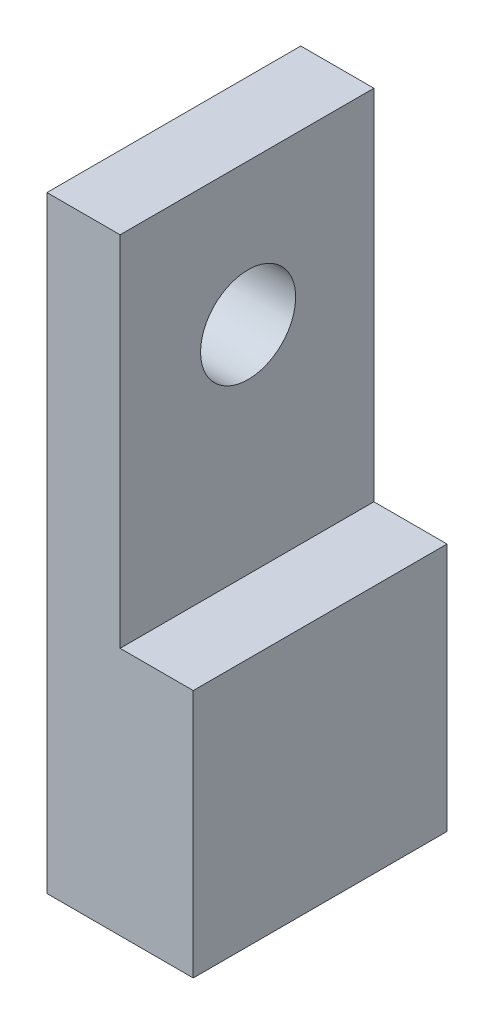
ISO-10303-21;
HEADER;
FILE_DESCRIPTION(('STEP AP214'),'2;1');
FILE_NAME('part.step','',(''),(''),'','','');
FILE_SCHEMA(('AUTOMOTIVE_DESIGN { 1 0 10303 214 1 1 1 1 }'));
ENDSEC;
DATA;
#1=APPLICATION_CONTEXT('core data for automotive mechanical design processes');
#2=APPLICATION_PROTOCOL_DEFINITION('international standard','automotive_design',2000,#1);
#3=PRODUCT_CONTEXT('',#1,'mechanical');
#4=PRODUCT('Part','Part','',(#3));
#5=PRODUCT_RELATED_PRODUCT_CATEGORY('part','',(#4));
#6=PRODUCT_DEFINITION_FORMATION('','',#4);
#7=PRODUCT_DEFINITION_CONTEXT('part definition',#1,'design');
#8=PRODUCT_DEFINITION('design','',#6,#7);
#9=PRODUCT_DEFINITION_SHAPE('','',#8);
#10=(LENGTH_UNIT() NAMED_UNIT(*) SI_UNIT(.MILLI.,.METRE.));
#11=(NAMED_UNIT(*) PLANE_ANGLE_UNIT() SI_UNIT($,.RADIAN.));
#12=(NAMED_UNIT(*) SI_UNIT($,.STERADIAN.) SOLID_ANGLE_UNIT());
#13=UNCERTAINTY_MEASURE_WITH_UNIT(LENGTH_MEASURE(1.E-05),#10,'distance_accuracy_value','');
#14=(GEOMETRIC_REPRESENTATION_CONTEXT(3) GLOBAL_UNCERTAINTY_ASSIGNED_CONTEXT((#13)) GLOBAL_UNIT_ASSIGNED_CONTEXT((#10,
#11,#12)) REPRESENTATION_CONTEXT('',''));
#15=CARTESIAN_POINT('',(0.,0.,0.));
#16=DIRECTION('',(0.,0.,1.));
#17=DIRECTION('',(1.,0.,0.));
#18=AXIS2_PLACEMENT_3D('',#15,#16,#17);
#19=CARTESIAN_POINT('',(-4.34310787671234,83.,-11.796875));
#20=DIRECTION('',(1.,0.,0.));
#21=DIRECTION('',(0.,0.,-1.));
#22=AXIS2_PLACEMENT_3D('',#19,#20,#21);
#23=PLANE('',#22);
#24=CARTESIAN_POINT('',(-4.34310787671234,51.1096452634034,-7.09687500000001));
#25=DIRECTION('',(-1.,0.,0.));
#26=DIRECTION('',(0.,0.,1.));
#27=AXIS2_PLACEMENT_3D('',#24,#25,#26);
#28=CIRCLE('',#27,1.24999999999999);
#29=CARTESIAN_POINT('',(-4.34310787671234,51.1096452634034,-5.84687500000002));
#30=VERTEX_POINT('',#29);
#31=EDGE_CURVE('E167',#30,#30,#28,.T.);
#32=ORIENTED_EDGE('',*,*,#31,.F.);
#33=EDGE_LOOP('',(#32));
#34=FACE_BOUND('',#33,.T.);
#35=CARTESIAN_POINT('',(-4.34310787671234,51.1096452634034,17.903125));
#36=DIRECTION('',(-1.,0.,0.));
#37=DIRECTION('',(0.,0.,1.));
#38=AXIS2_PLACEMENT_3D('',#35,#36,#37);
#39=CIRCLE('',#38,1.24999999999999);
#40=CARTESIAN_POINT('',(-4.34310787671234,51.1096452634034,19.153125));
#41=VERTEX_POINT('',#40);
#42=EDGE_CURVE('E161',#41,#41,#39,.T.);
#43=ORIENTED_EDGE('',*,*,#42,.F.);
#44=EDGE_LOOP('',(#43));
#45=FACE_BOUND('',#44,.T.);
#46=CARTESIAN_POINT('',(-4.34310787671234,76.1096452634034,17.903125));
#47=DIRECTION('',(-1.,0.,0.));
#48=DIRECTION('',(0.,0.,1.));
#49=AXIS2_PLACEMENT_3D('',#46,#47,#48);
#50=CIRCLE('',#49,1.24999999999999);
#51=CARTESIAN_POINT('',(-4.34310787671234,76.1096452634034,19.153125));
#52=VERTEX_POINT('',#51);
#53=EDGE_CURVE('E155',#52,#52,#50,.T.);
#54=ORIENTED_EDGE('',*,*,#53,.F.);
#55=EDGE_LOOP('',(#54));
#56=FACE_BOUND('',#55,.T.);
#57=CARTESIAN_POINT('',(-4.34310787671234,76.1096452634034,-7.09687500000001));
#58=DIRECTION('',(-1.,0.,0.));
#59=DIRECTION('',(0.,0.,1.));
#60=AXIS2_PLACEMENT_3D('',#57,#58,#59);
#61=CIRCLE('',#60,1.24999999999999);
#62=CARTESIAN_POINT('',(-4.34310787671234,76.1096452634034,-5.84687500000002));
#63=VERTEX_POINT('',#62);
#64=EDGE_CURVE('E149',#63,#63,#61,.T.);
#65=ORIENTED_EDGE('',*,*,#64,.F.);
#66=EDGE_LOOP('',(#65));
#67=FACE_BOUND('',#66,.T.);
#68=CARTESIAN_POINT('',(-4.34310787671234,63.6096452634034,5.40312499999999));
#69=DIRECTION('',(-1.,0.,0.));
#70=DIRECTION('',(0.,0.,1.));
#71=AXIS2_PLACEMENT_3D('',#68,#69,#70);
#72=CIRCLE('',#71,6.49999999999998);
#73=CARTESIAN_POINT('',(-4.34310787671234,63.6096452634034,11.903125));
#74=VERTEX_POINT('',#73);
#75=EDGE_CURVE('E143',#74,#74,#72,.T.);
#76=ORIENTED_EDGE('',*,*,#75,.F.);
#77=EDGE_LOOP('',(#76));
#78=FACE_BOUND('',#77,.T.);
#79=DIRECTION('',(0.,0.,1.));
#80=VECTOR('',#79,1.);
#81=CARTESIAN_POINT('',(-4.34310787671234,0.,-11.796875));
#82=LINE('',#81,#80);
#83=CARTESIAN_POINT('',(-4.34310787671234,0.,-11.796875));
#84=VERTEX_POINT('',#83);
#85=CARTESIAN_POINT('',(-4.34310787671233,0.,22.903125));
#86=VERTEX_POINT('',#85);
#87=EDGE_CURVE('E97',#84,#86,#82,.T.);
#88=ORIENTED_EDGE('',*,*,#87,.T.);
#89=DIRECTION('',(0.,-1.,0.));
#90=VECTOR('',#89,1.);
#91=CARTESIAN_POINT('',(-4.34310787671233,83.,22.903125));
#92=LINE('',#91,#90);
#93=CARTESIAN_POINT('',(-4.34310787671233,83.,22.903125));
#94=VERTEX_POINT('',#93);
#95=EDGE_CURVE('E11',#94,#86,#92,.T.);
#96=ORIENTED_EDGE('',*,*,#95,.F.);
#97=DIRECTION('',(0.,0.,1.));
#98=VECTOR('',#97,1.);
#99=CARTESIAN_POINT('',(-4.34310787671234,83.,-11.796875));
#100=LINE('',#99,#98);
#101=CARTESIAN_POINT('',(-4.34310787671234,83.,-11.796875));
#102=VERTEX_POINT('',#101);
#103=EDGE_CURVE('E91',#102,#94,#100,.T.);
#104=ORIENTED_EDGE('',*,*,#103,.F.);
#105=DIRECTION('',(0.,-1.,0.));
#106=VECTOR('',#105,1.);
#107=CARTESIAN_POINT('',(-4.34310787671234,83.,-11.796875));
#108=LINE('',#107,#106);
#109=EDGE_CURVE('E82',#102,#84,#108,.T.);
#110=ORIENTED_EDGE('',*,*,#109,.T.);
#111=EDGE_LOOP('',(#88,#96,#104,#110));
#112=FACE_BOUND('',#111,.T.);
#113=ADVANCED_FACE('F38',(#34,#45,#56,#67,#78,#112),#23,.F.);
#114=CARTESIAN_POINT('',(-4.34310787671233,83.,22.903125));
#115=DIRECTION('',(0.,0.,-1.));
#116=DIRECTION('',(-1.,0.,0.));
#117=AXIS2_PLACEMENT_3D('',#114,#115,#116);
#118=PLANE('',#117);
#119=DIRECTION('',(1.,0.,0.));
#120=VECTOR('',#119,1.);
#121=CARTESIAN_POINT('',(5.65689212328766,34.0349991484665,22.903125));
#122=LINE('',#121,#120);
#123=CARTESIAN_POINT('',(5.65689212328766,34.0349991484665,22.903125));
#124=VERTEX_POINT('',#123);
#125=CARTESIAN_POINT('',(15.6568921232877,34.0349991484665,22.903125));
#126=VERTEX_POINT('',#125);
#127=EDGE_CURVE('E137',#124,#126,#122,.T.);
#128=ORIENTED_EDGE('',*,*,#127,.F.);
#129=DIRECTION('',(0.,-1.,0.));
#130=VECTOR('',#129,1.);
#131=CARTESIAN_POINT('',(5.65689212328766,83.,22.903125));
#132=LINE('',#131,#130);
#133=CARTESIAN_POINT('',(5.65689212328766,83.,22.903125));
#134=VERTEX_POINT('',#133);
#135=EDGE_CURVE('E125',#134,#124,#132,.T.);
#136=ORIENTED_EDGE('',*,*,#135,.F.);
#137=DIRECTION('',(1.,0.,0.));
#138=VECTOR('',#137,1.);
#139=CARTESIAN_POINT('',(-4.34310787671233,83.,22.903125));
#140=LINE('',#139,#138);
#141=EDGE_CURVE('E122',#94,#134,#140,.T.);
#142=ORIENTED_EDGE('',*,*,#141,.F.);
#143=ORIENTED_EDGE('',*,*,#95,.T.);
#144=DIRECTION('',(1.,0.,0.));
#145=VECTOR('',#144,1.);
#146=CARTESIAN_POINT('',(-4.34310787671233,0.,22.903125));
#147=LINE('',#146,#145);
#148=CARTESIAN_POINT('',(15.6568921232877,0.,22.903125));
#149=VERTEX_POINT('',#148);
#150=EDGE_CURVE('E101',#86,#149,#147,.T.);
#151=ORIENTED_EDGE('',*,*,#150,.T.);
#152=DIRECTION('',(0.,-1.,0.));
#153=VECTOR('',#152,1.);
#154=CARTESIAN_POINT('',(15.6568921232877,83.,22.903125));
#155=LINE('',#154,#153);
#156=EDGE_CURVE('E45',#126,#149,#155,.T.);
#157=ORIENTED_EDGE('',*,*,#156,.F.);
#158=EDGE_LOOP('',(#128,#136,#142,#143,#151,#157));
#159=FACE_BOUND('',#158,.T.);
#160=ADVANCED_FACE('F119',(#159),#118,.F.);
#161=CARTESIAN_POINT('',(15.6568921232877,83.,-11.796875));
#162=DIRECTION('',(-1.,0.,0.));
#163=DIRECTION('',(0.,0.,1.));
#164=AXIS2_PLACEMENT_3D('',#161,#162,#163);
#165=PLANE('',#164);
#166=DIRECTION('',(0.,-1.,0.));
#167=VECTOR('',#166,1.);
#168=CARTESIAN_POINT('',(15.6568921232877,83.,-11.796875));
#169=LINE('',#168,#167);
#170=CARTESIAN_POINT('',(15.6568921232877,34.0349991484665,-11.796875));
#171=VERTEX_POINT('',#170);
#172=CARTESIAN_POINT('',(15.6568921232877,0.,-11.796875));
#173=VERTEX_POINT('',#172);
#174=EDGE_CURVE('E86',#171,#173,#169,.T.);
#175=ORIENTED_EDGE('',*,*,#174,.F.);
#176=DIRECTION('',(0.,0.,-1.));
#177=VECTOR('',#176,1.);
#178=CARTESIAN_POINT('',(15.6568921232877,34.0349991484665,22.904125));
#179=LINE('',#178,#177);
#180=EDGE_CURVE('E105',#126,#171,#179,.T.);
#181=ORIENTED_EDGE('',*,*,#180,.F.);
#182=ORIENTED_EDGE('',*,*,#156,.T.);
#183=DIRECTION('',(0.,0.,-1.));
#184=VECTOR('',#183,1.);
#185=CARTESIAN_POINT('',(15.6568921232877,0.,-11.796875));
#186=LINE('',#185,#184);
#187=EDGE_CURVE('E92',#149,#173,#186,.T.);
#188=ORIENTED_EDGE('',*,*,#187,.T.);
#189=EDGE_LOOP('',(#175,#181,#182,#188));
#190=FACE_BOUND('',#189,.T.);
#191=ADVANCED_FACE('F114',(#190),#165,.F.);
#192=CARTESIAN_POINT('',(-4.34310787671234,83.,-11.796875));
#193=DIRECTION('',(0.,0.,1.));
#194=DIRECTION('',(1.,0.,0.));
#195=AXIS2_PLACEMENT_3D('',#192,#193,#194);
#196=PLANE('',#195);
#197=DIRECTION('',(-1.,0.,0.));
#198=VECTOR('',#197,1.);
#199=CARTESIAN_POINT('',(-4.34310787671234,83.,-11.796875));
#200=LINE('',#199,#198);
#201=CARTESIAN_POINT('',(5.65689212328766,83.,-11.796875));
#202=VERTEX_POINT('',#201);
#203=EDGE_CURVE('E60',#202,#102,#200,.T.);
#204=ORIENTED_EDGE('',*,*,#203,.F.);
#205=DIRECTION('',(0.,1.,0.));
#206=VECTOR('',#205,1.);
#207=CARTESIAN_POINT('',(5.65689212328766,83.,-11.796875));
#208=LINE('',#207,#206);
#209=CARTESIAN_POINT('',(5.65689212328766,34.0349991484665,-11.796875));
#210=VERTEX_POINT('',#209);
#211=EDGE_CURVE('E52',#210,#202,#208,.T.);
#212=ORIENTED_EDGE('',*,*,#211,.F.);
#213=DIRECTION('',(-1.,0.,0.));
#214=VECTOR('',#213,1.);
#215=CARTESIAN_POINT('',(5.65689212328766,34.0349991484665,-11.796875));
#216=LINE('',#215,#214);
#217=EDGE_CURVE('E131',#171,#210,#216,.T.);
#218=ORIENTED_EDGE('',*,*,#217,.F.);
#219=ORIENTED_EDGE('',*,*,#174,.T.);
#220=DIRECTION('',(-1.,0.,0.));
#221=VECTOR('',#220,1.);
#222=CARTESIAN_POINT('',(-4.34310787671234,0.,-11.796875));
#223=LINE('',#222,#221);
#224=EDGE_CURVE('E79',#173,#84,#223,.T.);
#225=ORIENTED_EDGE('',*,*,#224,.T.);
#226=ORIENTED_EDGE('',*,*,#109,.F.);
#227=EDGE_LOOP('',(#204,#212,#218,#219,#225,#226));
#228=FACE_BOUND('',#227,.T.);
#229=ADVANCED_FACE('F81',(#228),#196,.F.);
#230=CARTESIAN_POINT('',(0.,83.,0.));
#231=DIRECTION('',(0.,1.,0.));
#232=DIRECTION('',(0.,0.,1.));
#233=AXIS2_PLACEMENT_3D('',#230,#231,#232);
#234=PLANE('',#233);
#235=DIRECTION('',(0.,0.,-1.));
#236=VECTOR('',#235,1.);
#237=CARTESIAN_POINT('',(5.65689212328766,83.,22.904125));
#238=LINE('',#237,#236);
#239=EDGE_CURVE('E129',#134,#202,#238,.T.);
#240=ORIENTED_EDGE('',*,*,#239,.T.);
#241=ORIENTED_EDGE('',*,*,#203,.T.);
#242=ORIENTED_EDGE('',*,*,#103,.T.);
#243=ORIENTED_EDGE('',*,*,#141,.T.);
#244=EDGE_LOOP('',(#240,#241,#242,#243));
#245=FACE_BOUND('',#244,.T.);
#246=ADVANCED_FACE('F126',(#245),#234,.T.);
#247=CARTESIAN_POINT('',(0.,0.,0.));
#248=DIRECTION('',(0.,1.,0.));
#249=DIRECTION('',(0.,0.,1.));
#250=AXIS2_PLACEMENT_3D('',#247,#248,#249);
#251=PLANE('',#250);
#252=CARTESIAN_POINT('',(5.65689212328767,0.,17.903125));
#253=DIRECTION('',(0.,-1.,0.));
#254=DIRECTION('',(0.,0.,-1.));
#255=AXIS2_PLACEMENT_3D('',#252,#253,#254);
#256=CIRCLE('',#255,2.);
#257=CARTESIAN_POINT('',(5.65689212328767,0.,15.903125));
#258=VERTEX_POINT('',#257);
#259=EDGE_CURVE('E185',#258,#258,#256,.T.);
#260=ORIENTED_EDGE('',*,*,#259,.F.);
#261=EDGE_LOOP('',(#260));
#262=FACE_BOUND('',#261,.T.);
#263=CARTESIAN_POINT('',(5.65689212328767,0.,-6.796875));
#264=DIRECTION('',(0.,-1.,0.));
#265=DIRECTION('',(0.,0.,-1.));
#266=AXIS2_PLACEMENT_3D('',#263,#264,#265);
#267=CIRCLE('',#266,2.);
#268=CARTESIAN_POINT('',(5.65689212328767,0.,-8.796875));
#269=VERTEX_POINT('',#268);
#270=EDGE_CURVE('E179',#269,#269,#267,.T.);
#271=ORIENTED_EDGE('',*,*,#270,.F.);
#272=EDGE_LOOP('',(#271));
#273=FACE_BOUND('',#272,.T.);
#274=CARTESIAN_POINT('',(5.65689212328766,0.,5.553125));
#275=DIRECTION('',(0.,-1.,0.));
#276=DIRECTION('',(0.,0.,-1.));
#277=AXIS2_PLACEMENT_3D('',#274,#275,#276);
#278=CIRCLE('',#277,2.5);
#279=CARTESIAN_POINT('',(5.65689212328766,0.,3.053125));
#280=VERTEX_POINT('',#279);
#281=EDGE_CURVE('E173',#280,#280,#278,.T.);
#282=ORIENTED_EDGE('',*,*,#281,.F.);
#283=EDGE_LOOP('',(#282));
#284=FACE_BOUND('',#283,.T.);
#285=ORIENTED_EDGE('',*,*,#87,.F.);
#286=ORIENTED_EDGE('',*,*,#224,.F.);
#287=ORIENTED_EDGE('',*,*,#187,.F.);
#288=ORIENTED_EDGE('',*,*,#150,.F.);
#289=EDGE_LOOP('',(#285,#286,#287,#288));
#290=FACE_BOUND('',#289,.T.);
#291=ADVANCED_FACE('F99',(#262,#273,#284,#290),#251,.F.);
#292=CARTESIAN_POINT('',(5.65689212328766,83.,22.904125));
#293=DIRECTION('',(-1.,0.,0.));
#294=DIRECTION('',(0.,0.,1.));
#295=AXIS2_PLACEMENT_3D('',#292,#293,#294);
#296=PLANE('',#295);
#297=CARTESIAN_POINT('',(5.65689212328766,63.6096452634034,5.40312499999999));
#298=DIRECTION('',(-1.,0.,0.));
#299=DIRECTION('',(0.,0.,1.));
#300=AXIS2_PLACEMENT_3D('',#297,#298,#299);
#301=CIRCLE('',#300,6.49999999999998);
#302=CARTESIAN_POINT('',(5.65689212328766,63.6096452634034,11.903125));
#303=VERTEX_POINT('',#302);
#304=EDGE_CURVE('E140',#303,#303,#301,.F.);
#305=ORIENTED_EDGE('',*,*,#304,.F.);
#306=EDGE_LOOP('',(#305));
#307=FACE_BOUND('',#306,.T.);
#308=ORIENTED_EDGE('',*,*,#135,.T.);
#309=DIRECTION('',(0.,0.,-1.));
#310=VECTOR('',#309,1.);
#311=CARTESIAN_POINT('',(5.65689212328766,34.0349991484665,22.904125));
#312=LINE('',#311,#310);
#313=EDGE_CURVE('E102',#124,#210,#312,.T.);
#314=ORIENTED_EDGE('',*,*,#313,.T.);
#315=ORIENTED_EDGE('',*,*,#211,.T.);
#316=ORIENTED_EDGE('',*,*,#239,.F.);
#317=EDGE_LOOP('',(#308,#314,#315,#316));
#318=FACE_BOUND('',#317,.T.);
#319=ADVANCED_FACE('F193',(#307,#318),#296,.F.);
#320=CARTESIAN_POINT('',(5.65689212328766,34.0349991484665,22.904125));
#321=DIRECTION('',(0.,-1.,0.));
#322=DIRECTION('',(0.,0.,-1.));
#323=AXIS2_PLACEMENT_3D('',#320,#321,#322);
#324=PLANE('',#323);
#325=ORIENTED_EDGE('',*,*,#127,.T.);
#326=ORIENTED_EDGE('',*,*,#180,.T.);
#327=ORIENTED_EDGE('',*,*,#217,.T.);
#328=ORIENTED_EDGE('',*,*,#313,.F.);
#329=EDGE_LOOP('',(#325,#326,#327,#328));
#330=FACE_BOUND('',#329,.T.);
#331=ADVANCED_FACE('F237',(#330),#324,.F.);
#332=CARTESIAN_POINT('',(15.6578921232877,63.6096452634034,5.40312499999999));
#333=DIRECTION('',(-1.,0.,0.));
#334=DIRECTION('',(0.,0.,1.));
#335=AXIS2_PLACEMENT_3D('',#332,#333,#334);
#336=CYLINDRICAL_SURFACE('',#335,6.49999999999998);
#337=ORIENTED_EDGE('',*,*,#75,.T.);
#338=EDGE_LOOP('',(#337));
#339=FACE_BOUND('',#338,.T.);
#340=ORIENTED_EDGE('',*,*,#304,.T.);
#341=EDGE_LOOP('',(#340));
#342=FACE_BOUND('',#341,.T.);
#343=ADVANCED_FACE('F233',(#339,#342),#336,.F.);
#344=CARTESIAN_POINT('',(3.15689212328767,76.1096452634034,-7.09687500000001));
#345=DIRECTION('',(-1.,0.,0.));
#346=DIRECTION('',(0.,0.,1.));
#347=AXIS2_PLACEMENT_3D('',#344,#345,#346);
#348=CONICAL_SURFACE('',#347,1.24999999999999,1.02974425867665);
#349=CARTESIAN_POINT('',(3.90796789707211,76.1096452634034,-7.09687500000001));
#350=VERTEX_POINT('',#349);
#351=VERTEX_LOOP('',#350);
#352=FACE_BOUND('',#351,.T.);
#353=CARTESIAN_POINT('',(3.15689212328767,76.1096452634034,-7.09687500000001));
#354=DIRECTION('',(-1.,0.,0.));
#355=DIRECTION('',(0.,0.,1.));
#356=AXIS2_PLACEMENT_3D('',#353,#354,#355);
#357=CIRCLE('',#356,1.24999999999999);
#358=CARTESIAN_POINT('',(3.15689212328767,76.1096452634034,-5.84687500000002));
#359=VERTEX_POINT('',#358);
#360=EDGE_CURVE('E146',#359,#359,#357,.T.);
#361=ORIENTED_EDGE('',*,*,#360,.T.);
#362=EDGE_LOOP('',(#361));
#363=FACE_BOUND('',#362,.T.);
#364=ADVANCED_FACE('F236',(#352,#363),#348,.F.);
#365=CARTESIAN_POINT('',(-4.34310787671234,76.1096452634034,-7.09687500000001));
#366=DIRECTION('',(-1.,0.,0.));
#367=DIRECTION('',(0.,0.,1.));
#368=AXIS2_PLACEMENT_3D('',#365,#366,#367);
#369=CYLINDRICAL_SURFACE('',#368,1.24999999999999);
#370=ORIENTED_EDGE('',*,*,#360,.F.);
#371=EDGE_LOOP('',(#370));
#372=FACE_BOUND('',#371,.T.);
#373=ORIENTED_EDGE('',*,*,#64,.T.);
#374=EDGE_LOOP('',(#373));
#375=FACE_BOUND('',#374,.T.);
#376=ADVANCED_FACE('F376',(#372,#375),#369,.F.);
#377=CARTESIAN_POINT('',(3.15689212328767,76.1096452634034,17.903125));
#378=DIRECTION('',(-1.,0.,0.));
#379=DIRECTION('',(0.,0.,1.));
#380=AXIS2_PLACEMENT_3D('',#377,#378,#379);
#381=CONICAL_SURFACE('',#380,1.24999999999999,1.02974425867665);
#382=CARTESIAN_POINT('',(3.90796789707211,76.1096452634034,17.903125));
#383=VERTEX_POINT('',#382);
#384=VERTEX_LOOP('',#383);
#385=FACE_BOUND('',#384,.T.);
#386=CARTESIAN_POINT('',(3.15689212328767,76.1096452634034,17.903125));
#387=DIRECTION('',(-1.,0.,0.));
#388=DIRECTION('',(0.,0.,1.));
#389=AXIS2_PLACEMENT_3D('',#386,#387,#388);
#390=CIRCLE('',#389,1.24999999999999);
#391=CARTESIAN_POINT('',(3.15689212328767,76.1096452634034,19.153125));
#392=VERTEX_POINT('',#391);
#393=EDGE_CURVE('E152',#392,#392,#390,.T.);
#394=ORIENTED_EDGE('',*,*,#393,.T.);
#395=EDGE_LOOP('',(#394));
#396=FACE_BOUND('',#395,.T.);
#397=ADVANCED_FACE('F366',(#385,#396),#381,.F.);
#398=CARTESIAN_POINT('',(-4.34310787671234,76.1096452634034,17.903125));
#399=DIRECTION('',(-1.,0.,0.));
#400=DIRECTION('',(0.,0.,1.));
#401=AXIS2_PLACEMENT_3D('',#398,#399,#400);
#402=CYLINDRICAL_SURFACE('',#401,1.24999999999999);
#403=ORIENTED_EDGE('',*,*,#393,.F.);
#404=EDGE_LOOP('',(#403));
#405=FACE_BOUND('',#404,.T.);
#406=ORIENTED_EDGE('',*,*,#53,.T.);
#407=EDGE_LOOP('',(#406));
#408=FACE_BOUND('',#407,.T.);
#409=ADVANCED_FACE('F357',(#405,#408),#402,.F.);
#410=CARTESIAN_POINT('',(3.15689212328767,51.1096452634034,17.903125));
#411=DIRECTION('',(-1.,0.,0.));
#412=DIRECTION('',(0.,0.,1.));
#413=AXIS2_PLACEMENT_3D('',#410,#411,#412);
#414=CONICAL_SURFACE('',#413,1.24999999999999,1.02974425867665);
#415=CARTESIAN_POINT('',(3.90796789707211,51.1096452634034,17.903125));
#416=VERTEX_POINT('',#415);
#417=VERTEX_LOOP('',#416);
#418=FACE_BOUND('',#417,.T.);
#419=CARTESIAN_POINT('',(3.15689212328767,51.1096452634034,17.903125));
#420=DIRECTION('',(-1.,0.,0.));
#421=DIRECTION('',(0.,0.,1.));
#422=AXIS2_PLACEMENT_3D('',#419,#420,#421);
#423=CIRCLE('',#422,1.24999999999999);
#424=CARTESIAN_POINT('',(3.15689212328767,51.1096452634034,19.153125));
#425=VERTEX_POINT('',#424);
#426=EDGE_CURVE('E158',#425,#425,#423,.T.);
#427=ORIENTED_EDGE('',*,*,#426,.T.);
#428=EDGE_LOOP('',(#427));
#429=FACE_BOUND('',#428,.T.);
#430=ADVANCED_FACE('F347',(#418,#429),#414,.F.);
#431=CARTESIAN_POINT('',(-4.34310787671234,51.1096452634034,17.903125));
#432=DIRECTION('',(-1.,0.,0.));
#433=DIRECTION('',(0.,0.,1.));
#434=AXIS2_PLACEMENT_3D('',#431,#432,#433);
#435=CYLINDRICAL_SURFACE('',#434,1.24999999999999);
#436=ORIENTED_EDGE('',*,*,#426,.F.);
#437=EDGE_LOOP('',(#436));
#438=FACE_BOUND('',#437,.T.);
#439=ORIENTED_EDGE('',*,*,#42,.T.);
#440=EDGE_LOOP('',(#439));
#441=FACE_BOUND('',#440,.T.);
#442=ADVANCED_FACE('F338',(#438,#441),#435,.F.);
#443=CARTESIAN_POINT('',(3.15689212328767,51.1096452634034,-7.09687500000001));
#444=DIRECTION('',(-1.,0.,0.));
#445=DIRECTION('',(0.,0.,1.));
#446=AXIS2_PLACEMENT_3D('',#443,#444,#445);
#447=CONICAL_SURFACE('',#446,1.24999999999999,1.02974425867665);
#448=CARTESIAN_POINT('',(3.90796789707211,51.1096452634034,-7.09687500000001));
#449=VERTEX_POINT('',#448);
#450=VERTEX_LOOP('',#449);
#451=FACE_BOUND('',#450,.T.);
#452=CARTESIAN_POINT('',(3.15689212328767,51.1096452634034,-7.09687500000001));
#453=DIRECTION('',(-1.,0.,0.));
#454=DIRECTION('',(0.,0.,1.));
#455=AXIS2_PLACEMENT_3D('',#452,#453,#454);
#456=CIRCLE('',#455,1.24999999999999);
#457=CARTESIAN_POINT('',(3.15689212328767,51.1096452634034,-5.84687500000002));
#458=VERTEX_POINT('',#457);
#459=EDGE_CURVE('E164',#458,#458,#456,.T.);
#460=ORIENTED_EDGE('',*,*,#459,.T.);
#461=EDGE_LOOP('',(#460));
#462=FACE_BOUND('',#461,.T.);
#463=ADVANCED_FACE('F328',(#451,#462),#447,.F.);
#464=CARTESIAN_POINT('',(-4.34310787671234,51.1096452634034,-7.09687500000001));
#465=DIRECTION('',(-1.,0.,0.));
#466=DIRECTION('',(0.,0.,1.));
#467=AXIS2_PLACEMENT_3D('',#464,#465,#466);
#468=CYLINDRICAL_SURFACE('',#467,1.24999999999999);
#469=ORIENTED_EDGE('',*,*,#459,.F.);
#470=EDGE_LOOP('',(#469));
#471=FACE_BOUND('',#470,.T.);
#472=ORIENTED_EDGE('',*,*,#31,.T.);
#473=EDGE_LOOP('',(#472));
#474=FACE_BOUND('',#473,.T.);
#475=ADVANCED_FACE('F212',(#471,#474),#468,.F.);
#476=CARTESIAN_POINT('',(5.65689212328766,15.,5.553125));
#477=DIRECTION('',(0.,-1.,0.));
#478=DIRECTION('',(0.,0.,-1.));
#479=AXIS2_PLACEMENT_3D('',#476,#477,#478);
#480=CONICAL_SURFACE('',#479,2.5,1.02974425867665);
#481=CARTESIAN_POINT('',(5.65689212328766,16.5021515475689,5.553125));
#482=VERTEX_POINT('',#481);
#483=VERTEX_LOOP('',#482);
#484=FACE_BOUND('',#483,.T.);
#485=CARTESIAN_POINT('',(5.65689212328766,15.,5.553125));
#486=DIRECTION('',(0.,-1.,0.));
#487=DIRECTION('',(0.,0.,-1.));
#488=AXIS2_PLACEMENT_3D('',#485,#486,#487);
#489=CIRCLE('',#488,2.5);
#490=CARTESIAN_POINT('',(5.65689212328766,15.,3.05312500000001));
#491=VERTEX_POINT('',#490);
#492=EDGE_CURVE('E170',#491,#491,#489,.T.);
#493=ORIENTED_EDGE('',*,*,#492,.T.);
#494=EDGE_LOOP('',(#493));
#495=FACE_BOUND('',#494,.T.);
#496=ADVANCED_FACE('F202',(#484,#495),#480,.F.);
#497=CARTESIAN_POINT('',(5.65689212328766,0.,5.553125));
#498=DIRECTION('',(0.,-1.,0.));
#499=DIRECTION('',(0.,0.,-1.));
#500=AXIS2_PLACEMENT_3D('',#497,#498,#499);
#501=CYLINDRICAL_SURFACE('',#500,2.5);
#502=ORIENTED_EDGE('',*,*,#492,.F.);
#503=EDGE_LOOP('',(#502));
#504=FACE_BOUND('',#503,.T.);
#505=ORIENTED_EDGE('',*,*,#281,.T.);
#506=EDGE_LOOP('',(#505));
#507=FACE_BOUND('',#506,.T.);
#508=ADVANCED_FACE('F199',(#504,#507),#501,.F.);
#509=CARTESIAN_POINT('',(5.65689212328767,5.2,-6.796875));
#510=DIRECTION('',(0.,-1.,0.));
#511=DIRECTION('',(0.,0.,-1.));
#512=AXIS2_PLACEMENT_3D('',#509,#510,#511);
#513=CONICAL_SURFACE('',#512,2.,1.02974425867665);
#514=CARTESIAN_POINT('',(5.65689212328766,6.40172123805512,-6.796875));
#515=VERTEX_POINT('',#514);
#516=VERTEX_LOOP('',#515);
#517=FACE_BOUND('',#516,.T.);
#518=CARTESIAN_POINT('',(5.65689212328767,5.2,-6.796875));
#519=DIRECTION('',(0.,-1.,0.));
#520=DIRECTION('',(0.,0.,-1.));
#521=AXIS2_PLACEMENT_3D('',#518,#519,#520);
#522=CIRCLE('',#521,2.);
#523=CARTESIAN_POINT('',(5.65689212328767,5.2,-8.79687499999999));
#524=VERTEX_POINT('',#523);
#525=EDGE_CURVE('E176',#524,#524,#522,.T.);
#526=ORIENTED_EDGE('',*,*,#525,.T.);
#527=EDGE_LOOP('',(#526));
#528=FACE_BOUND('',#527,.T.);
#529=ADVANCED_FACE('F201',(#517,#528),#513,.F.);
#530=CARTESIAN_POINT('',(5.65689212328767,0.,-6.796875));
#531=DIRECTION('',(0.,-1.,0.));
#532=DIRECTION('',(0.,0.,-1.));
#533=AXIS2_PLACEMENT_3D('',#530,#531,#532);
#534=CYLINDRICAL_SURFACE('',#533,2.);
#535=ORIENTED_EDGE('',*,*,#525,.F.);
#536=EDGE_LOOP('',(#535));
#537=FACE_BOUND('',#536,.T.);
#538=ORIENTED_EDGE('',*,*,#270,.T.);
#539=EDGE_LOOP('',(#538));
#540=FACE_BOUND('',#539,.T.);
#541=ADVANCED_FACE('F209',(#537,#540),#534,.F.);
#542=CARTESIAN_POINT('',(5.65689212328767,5.2,17.903125));
#543=DIRECTION('',(0.,-1.,0.));
#544=DIRECTION('',(0.,0.,-1.));
#545=AXIS2_PLACEMENT_3D('',#542,#543,#544);
#546=CONICAL_SURFACE('',#545,2.,1.02974425867665);
#547=CARTESIAN_POINT('',(5.65689212328766,6.40172123805512,17.903125));
#548=VERTEX_POINT('',#547);
#549=VERTEX_LOOP('',#548);
#550=FACE_BOUND('',#549,.T.);
#551=CARTESIAN_POINT('',(5.65689212328767,5.2,17.903125));
#552=DIRECTION('',(0.,-1.,0.));
#553=DIRECTION('',(0.,0.,-1.));
#554=AXIS2_PLACEMENT_3D('',#551,#552,#553);
#555=CIRCLE('',#554,2.);
#556=CARTESIAN_POINT('',(5.65689212328767,5.2,15.903125));
#557=VERTEX_POINT('',#556);
#558=EDGE_CURVE('E182',#557,#557,#555,.T.);
#559=ORIENTED_EDGE('',*,*,#558,.T.);
#560=EDGE_LOOP('',(#559));
#561=FACE_BOUND('',#560,.T.);
#562=ADVANCED_FACE('F273',(#550,#561),#546,.F.);
#563=CARTESIAN_POINT('',(5.65689212328767,0.,17.903125));
#564=DIRECTION('',(0.,-1.,0.));
#565=DIRECTION('',(0.,0.,-1.));
#566=AXIS2_PLACEMENT_3D('',#563,#564,#565);
#567=CYLINDRICAL_SURFACE('',#566,2.);
#568=ORIENTED_EDGE('',*,*,#558,.F.);
#569=EDGE_LOOP('',(#568));
#570=FACE_BOUND('',#569,.T.);
#571=ORIENTED_EDGE('',*,*,#259,.T.);
#572=EDGE_LOOP('',(#571));
#573=FACE_BOUND('',#572,.T.);
#574=ADVANCED_FACE('F189',(#570,#573),#567,.F.);
#575=CLOSED_SHELL('',(#113,#160,#191,#229,#246,#291,#319,#331,#343,#364,#376,#397,#409,#430,
#442,#463,#475,#496,#508,#529,#541,#562,#574));
#576=MANIFOLD_SOLID_BREP('B2',#575);
#577=ADVANCED_BREP_SHAPE_REPRESENTATION('',(#18,#576),#14);
#578=SHAPE_DEFINITION_REPRESENTATION(#9,#577);
ENDSEC;
END-ISO-10303-21;
